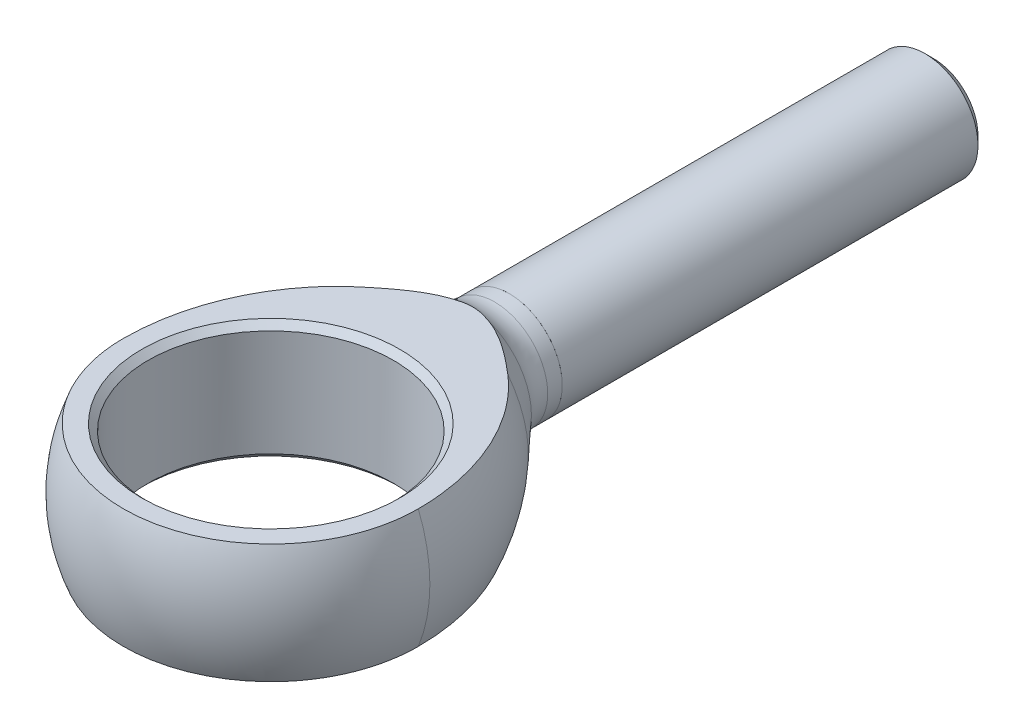
ISO-10303-21;
HEADER;
FILE_DESCRIPTION(('STEP AP214'),'2;1');
FILE_NAME('part.step','',(''),(''),'','','');
FILE_SCHEMA(('AUTOMOTIVE_DESIGN { 1 0 10303 214 1 1 1 1 }'));
ENDSEC;
DATA;
#1=APPLICATION_CONTEXT('core data for automotive mechanical design processes');
#2=APPLICATION_PROTOCOL_DEFINITION('international standard','automotive_design',2000,#1);
#3=PRODUCT_CONTEXT('',#1,'mechanical');
#4=PRODUCT('Part','Part','',(#3));
#5=PRODUCT_RELATED_PRODUCT_CATEGORY('part','',(#4));
#6=PRODUCT_DEFINITION_FORMATION('','',#4);
#7=PRODUCT_DEFINITION_CONTEXT('part definition',#1,'design');
#8=PRODUCT_DEFINITION('design','',#6,#7);
#9=PRODUCT_DEFINITION_SHAPE('','',#8);
#10=(LENGTH_UNIT() NAMED_UNIT(*) SI_UNIT(.MILLI.,.METRE.));
#11=(NAMED_UNIT(*) PLANE_ANGLE_UNIT() SI_UNIT($,.RADIAN.));
#12=(NAMED_UNIT(*) SI_UNIT($,.STERADIAN.) SOLID_ANGLE_UNIT());
#13=UNCERTAINTY_MEASURE_WITH_UNIT(LENGTH_MEASURE(1.E-05),#10,'distance_accuracy_value','');
#14=(GEOMETRIC_REPRESENTATION_CONTEXT(3) GLOBAL_UNCERTAINTY_ASSIGNED_CONTEXT((#13)) GLOBAL_UNIT_ASSIGNED_CONTEXT((#10,
#11,#12)) REPRESENTATION_CONTEXT('',''));
#15=CARTESIAN_POINT('',(0.,0.,0.));
#16=DIRECTION('',(0.,0.,1.));
#17=DIRECTION('',(1.,0.,0.));
#18=AXIS2_PLACEMENT_3D('',#15,#16,#17);
#19=CARTESIAN_POINT('',(0.,0.,39.6748));
#20=DIRECTION('',(0.,-1.,0.));
#21=DIRECTION('',(0.,0.,-1.));
#22=AXIS2_PLACEMENT_3D('',#19,#20,#21);
#23=CYLINDRICAL_SURFACE('',#22,7.3406);
#24=CARTESIAN_POINT('',(0.,-3.1877,39.6748));
#25=DIRECTION('',(0.,-1.,0.));
#26=DIRECTION('',(1.,0.,0.));
#27=AXIS2_PLACEMENT_3D('',#24,#25,#26);
#28=CIRCLE('',#27,7.3406);
#29=CARTESIAN_POINT('',(7.3406,-3.1877,39.6748));
#30=VERTEX_POINT('',#29);
#31=EDGE_CURVE('E116',#30,#30,#28,.T.);
#32=ORIENTED_EDGE('',*,*,#31,.T.);
#33=EDGE_LOOP('',(#32));
#34=FACE_BOUND('',#33,.T.);
#35=CARTESIAN_POINT('',(0.,3.1877,39.6748));
#36=DIRECTION('',(0.,1.,0.));
#37=DIRECTION('',(1.,0.,0.));
#38=AXIS2_PLACEMENT_3D('',#35,#36,#37);
#39=CIRCLE('',#38,7.3406);
#40=CARTESIAN_POINT('',(7.3406,3.1877,39.6748));
#41=VERTEX_POINT('',#40);
#42=EDGE_CURVE('E90',#41,#41,#39,.T.);
#43=ORIENTED_EDGE('',*,*,#42,.T.);
#44=EDGE_LOOP('',(#43));
#45=FACE_BOUND('',#44,.T.);
#46=ADVANCED_FACE('F16',(#34,#45),#23,.F.);
#47=CARTESIAN_POINT('',(0.,-3.5687,39.6748));
#48=DIRECTION('',(0.,-1.,0.));
#49=DIRECTION('',(0.,0.,-1.));
#50=AXIS2_PLACEMENT_3D('',#47,#48,#49);
#51=CONICAL_SURFACE('',#50,7.7216,0.78539816339745);
#52=ORIENTED_EDGE('',*,*,#31,.F.);
#53=EDGE_LOOP('',(#52));
#54=FACE_BOUND('',#53,.T.);
#55=CARTESIAN_POINT('',(0.,-3.5687,39.6748));
#56=DIRECTION('',(0.,-1.,0.));
#57=DIRECTION('',(0.,0.,-1.));
#58=AXIS2_PLACEMENT_3D('',#55,#56,#57);
#59=CIRCLE('',#58,7.7216);
#60=CARTESIAN_POINT('',(0.,-3.5687,31.9532));
#61=VERTEX_POINT('',#60);
#62=EDGE_CURVE('E21',#61,#61,#59,.T.);
#63=ORIENTED_EDGE('',*,*,#62,.T.);
#64=EDGE_LOOP('',(#63));
#65=FACE_BOUND('',#64,.T.);
#66=ADVANCED_FACE('F231',(#54,#65),#51,.F.);
#67=CARTESIAN_POINT('',(0.,3.5687,39.6748));
#68=DIRECTION('',(0.,1.,0.));
#69=DIRECTION('',(0.,0.,1.));
#70=AXIS2_PLACEMENT_3D('',#67,#68,#69);
#71=CONICAL_SURFACE('',#70,7.7216,0.78539816339745);
#72=ORIENTED_EDGE('',*,*,#42,.F.);
#73=EDGE_LOOP('',(#72));
#74=FACE_BOUND('',#73,.T.);
#75=CARTESIAN_POINT('',(0.,3.5687,39.6748));
#76=DIRECTION('',(0.,1.,0.));
#77=DIRECTION('',(0.,0.,1.));
#78=AXIS2_PLACEMENT_3D('',#75,#76,#77);
#79=CIRCLE('',#78,7.7216);
#80=CARTESIAN_POINT('',(0.,3.5687,47.3964));
#81=VERTEX_POINT('',#80);
#82=EDGE_CURVE('E109',#81,#81,#79,.T.);
#83=ORIENTED_EDGE('',*,*,#82,.T.);
#84=EDGE_LOOP('',(#83));
#85=FACE_BOUND('',#84,.T.);
#86=ADVANCED_FACE('F200',(#74,#85),#71,.F.);
#87=CARTESIAN_POINT('',(0.,0.,39.6748));
#88=DIRECTION('',(0.,0.,-1.));
#89=DIRECTION('',(-1.,0.,0.));
#90=AXIS2_PLACEMENT_3D('',#87,#88,#89);
#91=DEGENERATE_TOROIDAL_SURFACE('',#90,4.76249999999994,14.2874999999999,.F.);
#92=CARTESIAN_POINT('',(4.53573153434096,3.5687,30.0223049086918));
#93=CARTESIAN_POINT('',(4.64648576293524,3.5687,30.117302399158));
#94=CARTESIAN_POINT('',(4.75529966894867,3.5687,30.214530276842));
#95=CARTESIAN_POINT('',(4.96900945823194,3.5687,30.4131812578766));
#96=CARTESIAN_POINT('',(5.07390573225779,3.5687,30.514603940687));
#97=CARTESIAN_POINT('',(5.38254770100075,3.5687,30.8246474940286));
#98=CARTESIAN_POINT('',(5.58040477149253,3.5687,31.0391802608053));
#99=CARTESIAN_POINT('',(5.95954243889351,3.5687,31.481690431415));
#100=CARTESIAN_POINT('',(6.14085227159347,3.5687,31.7096429046874));
#101=CARTESIAN_POINT('',(6.48691224719287,3.5687,32.1778533220306));
#102=CARTESIAN_POINT('',(6.65165877204519,3.5687,32.418113937434));
#103=CARTESIAN_POINT('',(6.98566865145013,3.5687,32.9434024278442));
#104=CARTESIAN_POINT('',(7.15241710009485,3.5687,33.2300322429158));
#105=CARTESIAN_POINT('',(7.46318740684696,3.5687,33.8153569294234));
#106=CARTESIAN_POINT('',(7.60720809909156,3.5687,34.1140524188042));
#107=CARTESIAN_POINT('',(7.87206547108056,3.5687,34.7218850817827));
#108=CARTESIAN_POINT('',(7.99287979374436,3.5687,35.0310319905321));
#109=CARTESIAN_POINT('',(8.21064498832464,3.5687,35.6576157087496));
#110=CARTESIAN_POINT('',(8.30759646841529,3.5687,35.9750523067166));
#111=CARTESIAN_POINT('',(8.46529586292842,3.5687,36.5712471847872));
#112=CARTESIAN_POINT('',(8.52921684550582,3.5687,36.8491717212913));
#113=CARTESIAN_POINT('',(8.63892191677755,3.5687,37.4085599298032));
#114=CARTESIAN_POINT('',(8.68470753903626,3.5687,37.6900233004821));
#115=CARTESIAN_POINT('',(8.75792364371986,3.5687,38.2547743457093));
#116=CARTESIAN_POINT('',(8.78538921875067,3.5687,38.5380574768877));
#117=CARTESIAN_POINT('',(8.82203086855191,3.5687,39.1058265819836));
#118=CARTESIAN_POINT('',(8.83120549923354,3.5687,39.3903126490974));
#119=CARTESIAN_POINT('',(8.83119501030297,3.5687,39.6748));
#120=B_SPLINE_CURVE_WITH_KNOTS('',3,(#92,#93,#94,#95,#96,#97,#98,#99,#100,#101,#102,#103,#104,
#105,#106,#107,#108,#109,#110,#111,#112,#113,#114,#115,#116,#117,#118,#119),.UNSPECIFIED.,.F.,
.F.,(4,2,2,2,2,2,2,2,2,2,2,2,2,4),(0.,0.437676001290921,0.875308230275964,1.74994768524289,
2.62301062817699,3.4962638683035,4.4900430187027,5.48387313030376,6.47865595047768,
7.47341341475022,8.32837262265019,9.18325951795017,10.0365041124033,10.8898160687239),.UNSPECIFIED.);
#121=CARTESIAN_POINT('',(4.53573153428068,3.5687,30.0223049087466));
#122=VERTEX_POINT('',#121);
#123=CARTESIAN_POINT('',(8.83119501030297,3.5687,39.6748));
#124=VERTEX_POINT('',#123);
#125=EDGE_CURVE('E94',#122,#124,#120,.T.);
#126=ORIENTED_EDGE('',*,*,#125,.T.);
#127=CARTESIAN_POINT('',(0.,0.,39.6748));
#128=DIRECTION('',(0.,0.,1.));
#129=DIRECTION('',(1.,0.,0.));
#130=AXIS2_PLACEMENT_3D('',#127,#128,#129);
#131=CIRCLE('',#130,9.52500000000001);
#132=CARTESIAN_POINT('',(9.525,0.,39.6748));
#133=VERTEX_POINT('',#132);
#134=EDGE_CURVE('E85',#133,#124,#131,.T.);
#135=ORIENTED_EDGE('',*,*,#134,.F.);
#136=CARTESIAN_POINT('',(0.,0.,39.6748000000001));
#137=DIRECTION('',(0.,0.,-1.));
#138=DIRECTION('',(-1.,0.,0.));
#139=AXIS2_PLACEMENT_3D('',#136,#137,#138);
#140=CIRCLE('',#139,9.52499999999999);
#141=CARTESIAN_POINT('',(8.83119501030296,-3.5687,39.6748));
#142=VERTEX_POINT('',#141);
#143=EDGE_CURVE('E73',#133,#142,#140,.T.);
#144=ORIENTED_EDGE('',*,*,#143,.T.);
#145=CARTESIAN_POINT('',(8.83119501030298,-3.5687,39.6748));
#146=CARTESIAN_POINT('',(8.83123831016164,-3.5687,39.2696396775057));
#147=CARTESIAN_POINT('',(8.8126082645415,-3.5687,38.8644816279537));
#148=CARTESIAN_POINT('',(8.73830837516098,-3.5687,38.0574948990597));
#149=CARTESIAN_POINT('',(8.68263117250918,-3.5687,37.6556668972428));
#150=CARTESIAN_POINT('',(8.53424384266758,-3.5687,36.8572131919228));
#151=CARTESIAN_POINT('',(8.44138446058894,-3.5687,36.4606151914424));
#152=CARTESIAN_POINT('',(8.21928385480463,-3.5687,35.6778184111658));
#153=CARTESIAN_POINT('',(8.09004954110935,-3.5687,35.2916176714928));
#154=CARTESIAN_POINT('',(7.80867674698769,-3.5687,34.5656925456585));
#155=CARTESIAN_POINT('',(7.65947442628895,-3.5687,34.2248322305277));
#156=CARTESIAN_POINT('',(7.33223451333594,-3.5687,33.5573821144998));
#157=CARTESIAN_POINT('',(7.15419322899904,-3.5687,33.2307941476143));
#158=CARTESIAN_POINT('',(6.5792819363127,-3.5687,32.2786926519637));
#159=CARTESIAN_POINT('',(6.14027876983394,-3.5687,31.6773551317835));
#160=CARTESIAN_POINT('',(5.47714073271548,-3.5687,30.9269650194731));
#161=CARTESIAN_POINT('',(5.29768026565356,-3.5687,30.736938824473));
#162=CARTESIAN_POINT('',(5.01901759548722,-3.5687,30.4614761905751));
#163=CARTESIAN_POINT('',(4.92456362733509,-3.5687,30.3712619731917));
#164=CARTESIAN_POINT('',(4.73249951913429,-3.5687,30.1941987339203));
#165=CARTESIAN_POINT('',(4.63488841369071,-3.5687,30.1073507595597));
#166=CARTESIAN_POINT('',(4.53573153434155,-3.5687,30.0223049086923));
#167=B_SPLINE_CURVE_WITH_KNOTS('',3,(#145,#146,#147,#148,#149,#150,#151,#152,#153,#154,#155,
#156,#157,#158,#159,#160,#161,#162,#163,#164,#165,#166),.UNSPECIFIED.,.F.,.F.,(4,2,2,2,2,2,2,2,
2,2,4),(0.,1.21505053240972,2.43034248942414,3.65056251782993,4.87055090184374,5.98533436670334,
7.10026066368888,9.31903917529367,10.1027485937625,10.4945065468152,10.8863854463865),.UNSPECIFIED.);
#168=CARTESIAN_POINT('',(4.53573153432162,-3.5687,30.0223049087155));
#169=VERTEX_POINT('',#168);
#170=EDGE_CURVE('E222',#142,#169,#167,.T.);
#171=ORIENTED_EDGE('',*,*,#170,.T.);
#172=CARTESIAN_POINT('',(0.,0.,30.0223049087549));
#173=DIRECTION('',(0.,0.,1.));
#174=DIRECTION('',(1.,0.,0.));
#175=AXIS2_PLACEMENT_3D('',#172,#173,#174);
#176=CIRCLE('',#175,5.7713499496117);
#177=EDGE_CURVE('E106',#122,#169,#176,.F.);
#178=ORIENTED_EDGE('',*,*,#177,.F.);
#179=EDGE_LOOP('',(#126,#135,#144,#171,#178));
#180=FACE_BOUND('',#179,.T.);
#181=ADVANCED_FACE('F92',(#180),#91,.F.);
#182=CARTESIAN_POINT('',(0.,0.,39.6748));
#183=DIRECTION('',(1.,0.,0.));
#184=DIRECTION('',(0.,1.,0.));
#185=AXIS2_PLACEMENT_3D('',#182,#183,#184);
#186=SPHERICAL_SURFACE('',#185,9.52500000000001);
#187=CARTESIAN_POINT('',(8.83119501030297,3.5687,39.6748));
#188=CARTESIAN_POINT('',(8.83122171566859,3.5687,39.923180146276));
#189=CARTESIAN_POINT('',(8.82071747628649,3.5687,40.1715564511723));
#190=CARTESIAN_POINT('',(8.77883999257175,3.5687,40.6665321015705));
#191=CARTESIAN_POINT('',(8.74746774748768,3.5687,40.9131315315852));
#192=CARTESIAN_POINT('',(8.66407642168427,3.5687,41.4026361757057));
#193=CARTESIAN_POINT('',(8.61207186953437,3.5687,41.6455438647049));
#194=CARTESIAN_POINT('',(8.48779427998598,3.5687,42.1261143564974));
#195=CARTESIAN_POINT('',(8.41552148888246,3.5687,42.3637772229867));
#196=CARTESIAN_POINT('',(8.2511802240747,3.5687,42.8322811294422));
#197=CARTESIAN_POINT('',(8.15910259437063,3.5687,43.0631189577806));
#198=CARTESIAN_POINT('',(7.95582515814277,3.5687,43.5162199568318));
#199=CARTESIAN_POINT('',(7.84462504992993,3.5687,43.7384829921952));
#200=CARTESIAN_POINT('',(7.60391861433427,3.5687,44.1728060874066));
#201=CARTESIAN_POINT('',(7.47441599509076,3.5687,44.3848682023529));
#202=CARTESIAN_POINT('',(7.19800874545437,3.5687,44.7973292913575));
#203=CARTESIAN_POINT('',(7.05110419429008,3.5687,44.9977283185099));
#204=CARTESIAN_POINT('',(6.74095992416594,3.5687,45.3854109411177));
#205=CARTESIAN_POINT('',(6.57772263842186,3.5687,45.5726964831463));
#206=CARTESIAN_POINT('',(6.23599536569565,3.5687,45.9329165210914));
#207=CARTESIAN_POINT('',(6.05750011640509,3.5687,46.1058460249011));
#208=CARTESIAN_POINT('',(5.68658013615901,3.5687,46.436047189752));
#209=CARTESIAN_POINT('',(5.49415580037298,3.5687,46.5933192946945));
#210=CARTESIAN_POINT('',(5.09673824493745,3.5687,46.8910953331393));
#211=CARTESIAN_POINT('',(4.89174482901489,3.5687,47.0315990046924));
#212=CARTESIAN_POINT('',(4.47066275892946,3.5687,47.2948279422094));
#213=CARTESIAN_POINT('',(4.25457480487811,3.5687,47.4175543281311));
#214=CARTESIAN_POINT('',(3.81282319722303,3.5687,47.6443692020164));
#215=CARTESIAN_POINT('',(3.58715933316482,3.5687,47.7484572800942));
#216=CARTESIAN_POINT('',(3.12792179353987,3.5687,47.9372287476397));
#217=CARTESIAN_POINT('',(2.8943500901882,3.5687,48.0219169351131));
#218=CARTESIAN_POINT('',(2.42082194633713,3.5687,48.171345596247));
#219=CARTESIAN_POINT('',(2.18086333036626,3.5687,48.2360791761367));
#220=CARTESIAN_POINT('',(1.69638470349105,3.5687,48.3450897868325));
#221=CARTESIAN_POINT('',(1.45186544050128,3.5687,48.3893701416667));
#222=CARTESIAN_POINT('',(0.959960626560062,3.5687,48.4571757708174));
#223=CARTESIAN_POINT('',(0.712575014846095,3.5687,48.4807006043279));
#224=CARTESIAN_POINT('',(0.216698310362471,3.5687,48.5068264940322));
#225=CARTESIAN_POINT('',(-0.0317927960998583,3.5687,48.5094272903347));
#226=CARTESIAN_POINT('',(-0.528110776996124,3.5687,48.493685935912));
#227=CARTESIAN_POINT('',(-0.775937651427227,3.5687,48.4753437850975));
#228=CARTESIAN_POINT('',(-1.26916540058866,3.5687,48.4178469176815));
#229=CARTESIAN_POINT('',(-1.51456627367107,3.5687,48.3786921869435));
#230=CARTESIAN_POINT('',(-2.00119195968939,3.5687,48.2798495856406));
#231=CARTESIAN_POINT('',(-2.2424168611546,3.5687,48.2201621509238));
#232=CARTESIAN_POINT('',(-2.71902398626938,3.5687,48.0806657090128));
#233=CARTESIAN_POINT('',(-2.95440515063128,3.5687,48.0008530825814));
#234=CARTESIAN_POINT('',(-3.41752573306827,3.5687,47.8217101621286));
#235=CARTESIAN_POINT('',(-3.64526775950872,3.5687,47.7223866111477));
#236=CARTESIAN_POINT('',(-4.09162365225351,3.5687,47.5048874164072));
#237=CARTESIAN_POINT('',(-4.31023559290495,3.5687,47.386707820748));
#238=CARTESIAN_POINT('',(-4.73672151242847,3.5687,47.1323545419922));
#239=CARTESIAN_POINT('',(-4.94459572821736,3.5687,46.9961812561439));
#240=CARTESIAN_POINT('',(-5.34812735662121,3.5687,46.7068111212312));
#241=CARTESIAN_POINT('',(-5.54378514136452,3.5687,46.5536147911064));
#242=CARTESIAN_POINT('',(-5.92149687142085,3.5687,46.2312868284894));
#243=CARTESIAN_POINT('',(-6.10355102950633,3.5687,46.0621554453286));
#244=CARTESIAN_POINT('',(-6.45277277881423,3.5687,45.709149496455));
#245=CARTESIAN_POINT('',(-6.61993968181027,3.5687,45.5252742498905));
#246=CARTESIAN_POINT('',(-6.93813385928713,3.5687,45.1441606915925));
#247=CARTESIAN_POINT('',(-7.08916669533654,3.5687,44.9469270231936));
#248=CARTESIAN_POINT('',(-7.37415820825529,3.5687,44.5403380920559));
#249=CARTESIAN_POINT('',(-7.50810819431931,3.5687,44.3309767375619));
#250=CARTESIAN_POINT('',(-7.75788785254546,3.5687,43.90171877794));
#251=CARTESIAN_POINT('',(-7.87371807680518,3.5687,43.6818224940714));
#252=CARTESIAN_POINT('',(-8.08650700732415,3.5687,43.2329104545177));
#253=CARTESIAN_POINT('',(-8.18345368429091,3.5687,43.0038889970201));
#254=CARTESIAN_POINT('',(-8.35769175439011,3.5687,42.5384913816794));
#255=CARTESIAN_POINT('',(-8.43498357432824,3.5687,42.3021153836655));
#256=CARTESIAN_POINT('',(-8.56927791566514,3.5687,41.8240013913995));
#257=CARTESIAN_POINT('',(-8.62630625672867,3.5687,41.5822706406529));
#258=CARTESIAN_POINT('',(-8.71978509105483,3.5687,41.0949615845735));
#259=CARTESIAN_POINT('',(-8.75624568564022,3.5687,40.8493852289256));
#260=CARTESIAN_POINT('',(-8.79860297564235,3.5687,40.4485286765697));
#261=CARTESIAN_POINT('',(-8.81083277880204,3.5687,40.2938901404062));
#262=CARTESIAN_POINT('',(-8.82712294304932,3.5687,39.9844397692758));
#263=CARTESIAN_POINT('',(-8.83119677606848,3.56869999999999,39.8296286434136));
#264=CARTESIAN_POINT('',(-8.83119501030298,3.56869999999998,39.6748));
#265=B_SPLINE_CURVE_WITH_KNOTS('',3,(#187,#188,#189,#190,#191,#192,#193,#194,#195,#196,#197,
#198,#199,#200,#201,#202,#203,#204,#205,#206,#207,#208,#209,#210,#211,#212,#213,#214,#215,#216,
#217,#218,#219,#220,#221,#222,#223,#224,#225,#226,#227,#228,#229,#230,#231,#232,#233,#234,#235,
#236,#237,#238,#239,#240,#241,#242,#243,#244,#245,#246,#247,#248,#249,#250,#251,#252,#253,#254,
#255,#256,#257,#258,#259,#260,#261,#262,#263,#264),.UNSPECIFIED.,.F.,.F.,(4,2,2,2,2,2,2,2,2,2,2,
2,2,2,2,2,2,2,2,2,2,2,2,2,2,2,2,2,2,2,2,2,2,2,2,2,2,2,4),(0.,0.744912999131717,1.48979033123891,
2.23414407435863,2.97848877265495,3.72317833238488,4.4678796419146,5.21243028861929,
5.95697754561802,6.70141404625403,7.44610833905499,8.19078151308272,8.93546631855233,
9.68010418893147,10.4247584330668,11.1692283090497,11.9139550914973,12.6585607994195,
13.4031823209066,14.1478130911075,14.8924438644857,15.6370751436375,16.3816906174596,
17.1264400956935,17.8709326374356,18.6155814173474,19.3602137603283,20.1048234097635,
20.8494214104226,21.5940538154264,22.3384287044962,23.0831807921712,23.8279101833028,
24.5731124452109,25.3182985236518,26.0625316541528,26.8063989546481,27.2715654557138,
27.7359629644156),.UNSPECIFIED.);
#266=CARTESIAN_POINT('',(-8.83119501030296,3.5687,39.6748));
#267=VERTEX_POINT('',#266);
#268=EDGE_CURVE('E175',#124,#267,#265,.T.);
#269=ORIENTED_EDGE('',*,*,#268,.T.);
#270=CARTESIAN_POINT('',(0.,0.,39.6748));
#271=DIRECTION('',(0.,0.,-1.));
#272=DIRECTION('',(-1.,0.,0.));
#273=AXIS2_PLACEMENT_3D('',#270,#271,#272);
#274=CIRCLE('',#273,9.52499999999998);
#275=CARTESIAN_POINT('',(-9.525,0.,39.6748));
#276=VERTEX_POINT('',#275);
#277=EDGE_CURVE('E95',#276,#267,#274,.T.);
#278=ORIENTED_EDGE('',*,*,#277,.F.);
#279=CARTESIAN_POINT('',(0.,0.,39.6748));
#280=DIRECTION('',(0.,0.,-1.));
#281=DIRECTION('',(1.,0.,0.));
#282=AXIS2_PLACEMENT_3D('',#279,#280,#281);
#283=CIRCLE('',#282,9.52500000000001);
#284=CARTESIAN_POINT('',(-8.83119501030297,-3.5687,39.6748));
#285=VERTEX_POINT('',#284);
#286=EDGE_CURVE('E79',#276,#285,#283,.F.);
#287=ORIENTED_EDGE('',*,*,#286,.T.);
#288=CARTESIAN_POINT('',(-8.83119501030298,-3.5687,39.6748));
#289=CARTESIAN_POINT('',(-8.83122171566861,-3.5687,39.923180146276));
#290=CARTESIAN_POINT('',(-8.8207174762865,-3.5687,40.1715564511723));
#291=CARTESIAN_POINT('',(-8.77883999257175,-3.5687,40.6665321015705));
#292=CARTESIAN_POINT('',(-8.74746774748768,-3.5687,40.9131315315852));
#293=CARTESIAN_POINT('',(-8.66407642168428,-3.5687,41.4026361757057));
#294=CARTESIAN_POINT('',(-8.61207186953438,-3.5687,41.6455438647049));
#295=CARTESIAN_POINT('',(-8.48779427998599,-3.5687,42.1261143564974));
#296=CARTESIAN_POINT('',(-8.41552148888247,-3.5687,42.3637772229867));
#297=CARTESIAN_POINT('',(-8.25118022407471,-3.5687,42.8322811294422));
#298=CARTESIAN_POINT('',(-8.15910259437064,-3.5687,43.0631189577806));
#299=CARTESIAN_POINT('',(-7.95582515814277,-3.5687,43.5162199568318));
#300=CARTESIAN_POINT('',(-7.84462504992994,-3.5687,43.7384829921952));
#301=CARTESIAN_POINT('',(-7.60391861433428,-3.5687,44.1728060874066));
#302=CARTESIAN_POINT('',(-7.47441599509077,-3.5687,44.3848682023529));
#303=CARTESIAN_POINT('',(-7.19800874545437,-3.5687,44.7973292913575));
#304=CARTESIAN_POINT('',(-7.05110419429009,-3.56869999999999,44.99772831851));
#305=CARTESIAN_POINT('',(-6.74095992416594,-3.56869999999999,45.3854109411177));
#306=CARTESIAN_POINT('',(-6.57772263842186,-3.5687,45.5726964831463));
#307=CARTESIAN_POINT('',(-6.23599536569566,-3.5687,45.9329165210914));
#308=CARTESIAN_POINT('',(-6.0575001164051,-3.5687,46.1058460249011));
#309=CARTESIAN_POINT('',(-5.68658013615901,-3.5687,46.436047189752));
#310=CARTESIAN_POINT('',(-5.49415580037298,-3.5687,46.5933192946945));
#311=CARTESIAN_POINT('',(-5.09673824493745,-3.5687,46.8910953331393));
#312=CARTESIAN_POINT('',(-4.89174482901489,-3.5687,47.0315990046924));
#313=CARTESIAN_POINT('',(-4.47066275892946,-3.5687,47.2948279422094));
#314=CARTESIAN_POINT('',(-4.25457480487811,-3.5687,47.4175543281311));
#315=CARTESIAN_POINT('',(-3.81282319722303,-3.5687,47.6443692020164));
#316=CARTESIAN_POINT('',(-3.58715933316482,-3.5687,47.7484572800942));
#317=CARTESIAN_POINT('',(-3.12792179353987,-3.5687,47.9372287476398));
#318=CARTESIAN_POINT('',(-2.8943500901882,-3.5687,48.0219169351131));
#319=CARTESIAN_POINT('',(-2.42082194633712,-3.5687,48.171345596247));
#320=CARTESIAN_POINT('',(-2.18086333036625,-3.5687,48.2360791761367));
#321=CARTESIAN_POINT('',(-1.69638470349104,-3.5687,48.3450897868325));
#322=CARTESIAN_POINT('',(-1.45186544050128,-3.5687,48.3893701416667));
#323=CARTESIAN_POINT('',(-0.959960626560058,-3.5687,48.4571757708174));
#324=CARTESIAN_POINT('',(-0.71257501484609,-3.5687,48.4807006043279));
#325=CARTESIAN_POINT('',(-0.216698310362466,-3.5687,48.5068264940322));
#326=CARTESIAN_POINT('',(0.0317927960998628,-3.5687,48.5094272903347));
#327=CARTESIAN_POINT('',(0.528110776996129,-3.5687,48.493685935912));
#328=CARTESIAN_POINT('',(0.775937651427232,-3.5687,48.4753437850975));
#329=CARTESIAN_POINT('',(1.26916540058866,-3.5687,48.4178469176815));
#330=CARTESIAN_POINT('',(1.51456627367107,-3.5687,48.3786921869435));
#331=CARTESIAN_POINT('',(2.0011919596894,-3.5687,48.2798495856406));
#332=CARTESIAN_POINT('',(2.24241686115461,-3.5687,48.2201621509238));
#333=CARTESIAN_POINT('',(2.71902398626939,-3.5687,48.0806657090128));
#334=CARTESIAN_POINT('',(2.95440515063128,-3.5687,48.0008530825813));
#335=CARTESIAN_POINT('',(3.41752573306827,-3.5687,47.8217101621286));
#336=CARTESIAN_POINT('',(3.64526775950872,-3.5687,47.7223866111477));
#337=CARTESIAN_POINT('',(4.09162365225352,-3.5687,47.5048874164072));
#338=CARTESIAN_POINT('',(4.31023559290496,-3.5687,47.386707820748));
#339=CARTESIAN_POINT('',(4.73672151242848,-3.5687,47.1323545419922));
#340=CARTESIAN_POINT('',(4.94459572821737,-3.5687,46.9961812561439));
#341=CARTESIAN_POINT('',(5.34812735662121,-3.5687,46.7068111212312));
#342=CARTESIAN_POINT('',(5.54378514136452,-3.5687,46.5536147911064));
#343=CARTESIAN_POINT('',(5.92149687142086,-3.5687,46.2312868284894));
#344=CARTESIAN_POINT('',(6.10355102950633,-3.5687,46.0621554453286));
#345=CARTESIAN_POINT('',(6.45277277881423,-3.5687,45.709149496455));
#346=CARTESIAN_POINT('',(6.61993968181027,-3.5687,45.5252742498905));
#347=CARTESIAN_POINT('',(6.93813385928713,-3.5687,45.1441606915925));
#348=CARTESIAN_POINT('',(7.08916669533655,-3.5687,44.9469270231936));
#349=CARTESIAN_POINT('',(7.37415820825529,-3.5687,44.5403380920558));
#350=CARTESIAN_POINT('',(7.50810819431931,-3.5687,44.3309767375619));
#351=CARTESIAN_POINT('',(7.75788785254546,-3.5687,43.9017187779399));
#352=CARTESIAN_POINT('',(7.87371807680518,-3.5687,43.6818224940714));
#353=CARTESIAN_POINT('',(8.08650700732415,-3.5687,43.2329104545177));
#354=CARTESIAN_POINT('',(8.18345368429091,-3.5687,43.0038889970201));
#355=CARTESIAN_POINT('',(8.3576917543901,-3.5687,42.5384913816794));
#356=CARTESIAN_POINT('',(8.43498357432824,-3.5687,42.3021153836654));
#357=CARTESIAN_POINT('',(8.56927791566514,-3.5687,41.8240013913995));
#358=CARTESIAN_POINT('',(8.62630625672867,-3.5687,41.5822706406529));
#359=CARTESIAN_POINT('',(8.71978509105482,-3.5687,41.0949615845734));
#360=CARTESIAN_POINT('',(8.75624568564022,-3.5687,40.8493852289255));
#361=CARTESIAN_POINT('',(8.79860297564234,-3.5687,40.4485286765696));
#362=CARTESIAN_POINT('',(8.81083277880203,-3.5687,40.2938901404062));
#363=CARTESIAN_POINT('',(8.82712294304931,-3.5687,39.9844397692758));
#364=CARTESIAN_POINT('',(8.83119677606847,-3.56869999999999,39.8296286434136));
#365=CARTESIAN_POINT('',(8.83119501030297,-3.56869999999998,39.6748));
#366=B_SPLINE_CURVE_WITH_KNOTS('',3,(#288,#289,#290,#291,#292,#293,#294,#295,#296,#297,#298,
#299,#300,#301,#302,#303,#304,#305,#306,#307,#308,#309,#310,#311,#312,#313,#314,#315,#316,#317,
#318,#319,#320,#321,#322,#323,#324,#325,#326,#327,#328,#329,#330,#331,#332,#333,#334,#335,#336,
#337,#338,#339,#340,#341,#342,#343,#344,#345,#346,#347,#348,#349,#350,#351,#352,#353,#354,#355,
#356,#357,#358,#359,#360,#361,#362,#363,#364,#365),.UNSPECIFIED.,.F.,.F.,(4,2,2,2,2,2,2,2,2,2,2,
2,2,2,2,2,2,2,2,2,2,2,2,2,2,2,2,2,2,2,2,2,2,2,2,2,2,2,4),(0.,0.744912999131717,1.48979033123891,
2.23414407435864,2.97848877265496,3.7231783323849,4.46787964191461,5.2124302886193,
5.95697754561803,6.70141404625403,7.446108339055,8.19078151308273,8.93546631855235,
9.68010418893148,10.4247584330668,11.1692283090497,11.9139550914973,12.6585607994195,
13.4031823209066,14.1478130911076,14.8924438644857,15.6370751436375,16.3816906174596,
17.1264400956935,17.8709326374356,18.6155814173474,19.3602137603283,20.1048234097635,
20.8494214104226,21.5940538154264,22.3384287044962,23.0831807921712,23.8279101833028,
24.5731124452109,25.3182985236518,26.0625316541529,26.8063989546481,27.2715654557138,
27.7359629644156),.UNSPECIFIED.);
#367=EDGE_CURVE('E88',#285,#142,#366,.T.);
#368=ORIENTED_EDGE('',*,*,#367,.T.);
#369=ORIENTED_EDGE('',*,*,#143,.F.);
#370=ORIENTED_EDGE('',*,*,#134,.T.);
#371=EDGE_LOOP('',(#269,#278,#287,#368,#369,#370));
#372=FACE_BOUND('',#371,.T.);
#373=ADVANCED_FACE('F84',(#372),#186,.T.);
#374=CARTESIAN_POINT('',(0.,0.,39.6748));
#375=DIRECTION('',(0.,0.,-1.));
#376=DIRECTION('',(-1.,0.,0.));
#377=AXIS2_PLACEMENT_3D('',#374,#375,#376);
#378=DEGENERATE_TOROIDAL_SURFACE('',#377,4.76249999999994,14.2874999999999,.F.);
#379=CARTESIAN_POINT('',(-8.83119501030295,3.5687,39.6748));
#380=CARTESIAN_POINT('',(-8.83123831016162,3.5687,39.2696396775057));
#381=CARTESIAN_POINT('',(-8.81260826454148,3.5687,38.8644816279537));
#382=CARTESIAN_POINT('',(-8.73830837516095,3.5687,38.0574948990597));
#383=CARTESIAN_POINT('',(-8.68263117250915,3.5687,37.6556668972428));
#384=CARTESIAN_POINT('',(-8.53424384266755,3.5687,36.8572131919228));
#385=CARTESIAN_POINT('',(-8.44138446058891,3.5687,36.4606151914424));
#386=CARTESIAN_POINT('',(-8.2192838548046,3.5687,35.6778184111658));
#387=CARTESIAN_POINT('',(-8.09004954110932,3.5687,35.2916176714928));
#388=CARTESIAN_POINT('',(-7.80867674698766,3.5687,34.5656925456585));
#389=CARTESIAN_POINT('',(-7.65947442628892,3.5687,34.2248322305277));
#390=CARTESIAN_POINT('',(-7.33223451333592,3.5687,33.5573821144998));
#391=CARTESIAN_POINT('',(-7.15419322899902,3.5687,33.2307941476143));
#392=CARTESIAN_POINT('',(-6.57928193631267,3.5687,32.2786926519637));
#393=CARTESIAN_POINT('',(-6.14027876983392,3.5687,31.6773551317835));
#394=CARTESIAN_POINT('',(-5.47714073271546,3.5687,30.9269650194731));
#395=CARTESIAN_POINT('',(-5.29768026565355,3.5687,30.7369388244731));
#396=CARTESIAN_POINT('',(-5.01901759548721,3.5687,30.4614761905751));
#397=CARTESIAN_POINT('',(-4.92456362733508,3.5687,30.3712619731917));
#398=CARTESIAN_POINT('',(-4.73249951913428,3.5687,30.1941987339203));
#399=CARTESIAN_POINT('',(-4.6348884136907,3.5687,30.1073507595597));
#400=CARTESIAN_POINT('',(-4.53573153434154,3.5687,30.0223049086923));
#401=B_SPLINE_CURVE_WITH_KNOTS('',3,(#379,#380,#381,#382,#383,#384,#385,#386,#387,#388,#389,
#390,#391,#392,#393,#394,#395,#396,#397,#398,#399,#400),.UNSPECIFIED.,.F.,.F.,(4,2,2,2,2,2,2,2,
2,2,4),(0.,1.21505053240972,2.43034248942414,3.65056251782993,4.87055090184374,5.98533436670334,
7.10026066368889,9.31903917529367,10.1027485937625,10.4945065468152,10.8863854463865),.UNSPECIFIED.);
#402=CARTESIAN_POINT('',(-4.53573153432161,3.5687,30.0223049087155));
#403=VERTEX_POINT('',#402);
#404=EDGE_CURVE('E289',#267,#403,#401,.T.);
#405=ORIENTED_EDGE('',*,*,#404,.T.);
#406=CARTESIAN_POINT('',(0.,0.,30.0223049087549));
#407=DIRECTION('',(0.,0.,1.));
#408=DIRECTION('',(1.,0.,0.));
#409=AXIS2_PLACEMENT_3D('',#406,#407,#408);
#410=CIRCLE('',#409,5.7713499496117);
#411=CARTESIAN_POINT('',(-4.53573153428068,-3.5687,30.0223049087466));
#412=VERTEX_POINT('',#411);
#413=EDGE_CURVE('E171',#412,#403,#410,.F.);
#414=ORIENTED_EDGE('',*,*,#413,.F.);
#415=CARTESIAN_POINT('',(-4.53573153434096,-3.5687,30.0223049086918));
#416=CARTESIAN_POINT('',(-4.64648576293523,-3.5687,30.117302399158));
#417=CARTESIAN_POINT('',(-4.75529966894867,-3.5687,30.214530276842));
#418=CARTESIAN_POINT('',(-4.96900945823193,-3.5687,30.4131812578766));
#419=CARTESIAN_POINT('',(-5.07390573225779,-3.5687,30.514603940687));
#420=CARTESIAN_POINT('',(-5.38254770100075,-3.5687,30.8246474940286));
#421=CARTESIAN_POINT('',(-5.58040477149252,-3.5687,31.0391802608053));
#422=CARTESIAN_POINT('',(-5.95954243889351,-3.5687,31.481690431415));
#423=CARTESIAN_POINT('',(-6.14085227159346,-3.5687,31.7096429046874));
#424=CARTESIAN_POINT('',(-6.48691224719287,-3.5687,32.1778533220306));
#425=CARTESIAN_POINT('',(-6.65165877204519,-3.5687,32.418113937434));
#426=CARTESIAN_POINT('',(-6.98566865145013,-3.5687,32.9434024278442));
#427=CARTESIAN_POINT('',(-7.15241710009485,-3.5687,33.2300322429158));
#428=CARTESIAN_POINT('',(-7.46318740684695,-3.5687,33.8153569294234));
#429=CARTESIAN_POINT('',(-7.60720809909155,-3.5687,34.1140524188042));
#430=CARTESIAN_POINT('',(-7.87206547108056,-3.5687,34.7218850817827));
#431=CARTESIAN_POINT('',(-7.99287979374436,-3.5687,35.0310319905321));
#432=CARTESIAN_POINT('',(-8.21064498832463,-3.5687,35.6576157087496));
#433=CARTESIAN_POINT('',(-8.30759646841529,-3.5687,35.9750523067166));
#434=CARTESIAN_POINT('',(-8.46529586292841,-3.5687,36.5712471847872));
#435=CARTESIAN_POINT('',(-8.52921684550581,-3.5687,36.8491717212913));
#436=CARTESIAN_POINT('',(-8.63892191677754,-3.5687,37.4085599298032));
#437=CARTESIAN_POINT('',(-8.68470753903624,-3.5687,37.6900233004821));
#438=CARTESIAN_POINT('',(-8.75792364371985,-3.5687,38.2547743457093));
#439=CARTESIAN_POINT('',(-8.78538921875066,-3.5687,38.5380574768877));
#440=CARTESIAN_POINT('',(-8.8220308685519,-3.5687,39.1058265819836));
#441=CARTESIAN_POINT('',(-8.83120549923353,-3.5687,39.3903126490974));
#442=CARTESIAN_POINT('',(-8.83119501030296,-3.5687,39.6748));
#443=B_SPLINE_CURVE_WITH_KNOTS('',3,(#415,#416,#417,#418,#419,#420,#421,#422,#423,#424,#425,
#426,#427,#428,#429,#430,#431,#432,#433,#434,#435,#436,#437,#438,#439,#440,#441,#442),
.UNSPECIFIED.,.F.,.F.,(4,2,2,2,2,2,2,2,2,2,2,2,2,4),(0.,0.43767600129092,0.875308230275964,
1.74994768524289,2.62301062817699,3.4962638683035,4.4900430187027,5.48387313030375,
6.47865595047767,7.47341341475023,8.32837262265019,9.18325951795016,10.0365041124033,
10.8898160687239),.UNSPECIFIED.);
#444=EDGE_CURVE('E209',#412,#285,#443,.T.);
#445=ORIENTED_EDGE('',*,*,#444,.T.);
#446=ORIENTED_EDGE('',*,*,#286,.F.);
#447=ORIENTED_EDGE('',*,*,#277,.T.);
#448=EDGE_LOOP('',(#405,#414,#445,#446,#447));
#449=FACE_BOUND('',#448,.T.);
#450=ADVANCED_FACE('F18',(#449),#378,.F.);
#451=CARTESIAN_POINT('',(9.525,-3.5687,39.6748));
#452=DIRECTION('',(0.,1.,0.));
#453=DIRECTION('',(-1.,0.,0.));
#454=AXIS2_PLACEMENT_3D('',#451,#452,#453);
#455=PLANE('',#454);
#456=ORIENTED_EDGE('',*,*,#444,.F.);
#457=CARTESIAN_POINT('',(-1.29266625592802,-3.56870000003515,27.8661559850313));
#458=CARTESIAN_POINT('',(-1.39756229416509,-3.56870000001261,27.9051678132153));
#459=CARTESIAN_POINT('',(-1.50103230112086,-3.56870000000338,27.9477951572748));
#460=CARTESIAN_POINT('',(-1.70515646340838,-3.56869999999662,28.0390644279456));
#461=CARTESIAN_POINT('',(-1.80581367441419,-3.56869999999909,28.087699489724));
#462=CARTESIAN_POINT('',(-2.00421589828348,-3.5687000000009,28.1896715055381));
#463=CARTESIAN_POINT('',(-2.10197034494298,-3.56870000000025,28.242990311058));
#464=CARTESIAN_POINT('',(-2.29522551907263,-3.56869999999975,28.3536153058766));
#465=CARTESIAN_POINT('',(-2.39072551944572,-3.56869999999991,28.4109227586747));
#466=CARTESIAN_POINT('',(-2.67276097034969,-3.56870000000017,28.5867972829336));
#467=CARTESIAN_POINT('',(-2.85633035442531,-3.56870000000004,28.7101148582793));
#468=CARTESIAN_POINT('',(-3.21742984297457,-3.56869999999995,28.9655135596928));
#469=CARTESIAN_POINT('',(-3.39495400254418,-3.56869999999999,29.0976029557909));
#470=CARTESIAN_POINT('',(-3.65225119547343,-3.5687,29.2962005457707));
#471=CARTESIAN_POINT('',(-3.73389564695686,-3.5687,29.3603051357153));
#472=CARTESIAN_POINT('',(-3.89621397782917,-3.5687,29.4896675316165));
#473=CARTESIAN_POINT('',(-3.97688822723677,-3.5687,29.5549248728728));
#474=CARTESIAN_POINT('',(-4.13767538313368,-3.5687,29.6866767151875));
#475=CARTESIAN_POINT('',(-4.21778546463666,-3.5687,29.7531746566265));
#476=CARTESIAN_POINT('',(-4.3772846881678,-3.5687,29.887088711996));
#477=CARTESIAN_POINT('',(-4.45667355665177,-3.5687,29.9545051518974));
#478=CARTESIAN_POINT('',(-4.53573153430125,-3.5687,30.0223049087384));
#479=B_SPLINE_CURVE_WITH_KNOTS('',3,(#457,#458,#459,#460,#461,#462,#463,#464,#465,#466,#467,
#468,#469,#470,#471,#472,#473,#474,#475,#476,#477,#478),.UNSPECIFIED.,.F.,.F.,(4,2,2,2,2,2,2,2,
2,2,4),(0.,0.335569250774936,0.670758543703163,1.00470196211775,1.33875165082478,
2.00176973217835,2.66542203046743,2.97682459663314,3.28810437139979,3.60043795660698,
3.91288543482328),.UNSPECIFIED.);
#480=CARTESIAN_POINT('',(-1.29266625594848,-3.5687,27.8661559849762));
#481=VERTEX_POINT('',#480);
#482=EDGE_CURVE('E218',#481,#412,#479,.T.);
#483=ORIENTED_EDGE('',*,*,#482,.F.);
#484=CARTESIAN_POINT('',(-1.29266625597418,-3.5687,27.8661559849071));
#485=CARTESIAN_POINT('',(-1.24590949930305,-3.5687,27.848784647138));
#486=CARTESIAN_POINT('',(-1.19905037373049,-3.5687,27.8316737560573));
#487=CARTESIAN_POINT('',(-1.10474069453062,-3.5687,27.7981495762703));
#488=CARTESIAN_POINT('',(-1.05728827649368,-3.5687,27.7817415487452));
#489=CARTESIAN_POINT('',(-0.961843130950875,-3.5687,27.7499772652667));
#490=CARTESIAN_POINT('',(-0.913849086912329,-3.5687,27.7346249295995));
#491=CARTESIAN_POINT('',(-0.817362634894791,-3.5687,27.7053649953359));
#492=CARTESIAN_POINT('',(-0.768869747586812,-3.5687,27.6914589640255));
#493=CARTESIAN_POINT('',(-0.672474105231117,-3.5687,27.6657793258056));
#494=CARTESIAN_POINT('',(-0.624582273844401,-3.5687,27.6539651113966));
#495=CARTESIAN_POINT('',(-0.528397414051101,-3.5687,27.6324910370669));
#496=CARTESIAN_POINT('',(-0.480105197314078,-3.5687,27.6228275818165));
#497=CARTESIAN_POINT('',(-0.383164247403699,-3.5687,27.6060080521037));
#498=CARTESIAN_POINT('',(-0.334516259062664,-3.5687,27.5988477468718));
#499=CARTESIAN_POINT('',(-0.236925317878908,-3.5687,27.5873248578102));
#500=CARTESIAN_POINT('',(-0.187982617068537,-3.5687,27.5829601536593));
#501=CARTESIAN_POINT('',(-0.0726240669259666,-3.5687,27.576229522652));
#502=CARTESIAN_POINT('',(-0.00613013529106449,-3.5687,27.575110436846));
#503=CARTESIAN_POINT('',(0.126803575040329,-3.5687,27.5784906482719));
#504=CARTESIAN_POINT('',(0.193243134991525,-3.5687,27.5829981040683));
#505=CARTESIAN_POINT('',(0.325561030235452,-3.5687,27.5972342530579));
#506=CARTESIAN_POINT('',(0.391439234763328,-3.5687,27.6069641307392));
#507=CARTESIAN_POINT('',(0.522547680151476,-3.5687,27.630904449964));
#508=CARTESIAN_POINT('',(0.587775585916763,-3.5687,27.6451273795652));
#509=CARTESIAN_POINT('',(0.717326740502742,-3.5687,27.6771155059122));
#510=CARTESIAN_POINT('',(0.781650154458633,-3.5687,27.6948800468271));
#511=CARTESIAN_POINT('',(0.909492978047648,-3.5687,27.7330520409466));
#512=CARTESIAN_POINT('',(0.973012422695515,-3.5687,27.7534593786133));
#513=CARTESIAN_POINT('',(1.079298585532,-3.5687,27.7893333526161));
#514=CARTESIAN_POINT('',(1.12223499290128,-3.5687,27.804304867834));
#515=CARTESIAN_POINT('',(1.20769678540526,-3.5687,27.8348322527672));
#516=CARTESIAN_POINT('',(1.25022313951327,-3.5687,27.8503854029923));
#517=CARTESIAN_POINT('',(1.29266625598152,-3.5687,27.8661559849098));
#518=B_SPLINE_CURVE_WITH_KNOTS('',3,(#484,#485,#486,#487,#488,#489,#490,#491,#492,#493,#494,
#495,#496,#497,#498,#499,#500,#501,#502,#503,#504,#505,#506,#507,#508,#509,#510,#511,#512,#513,
#514,#515,#516,#517),.UNSPECIFIED.,.F.,.F.,(4,2,2,2,2,2,2,2,2,2,2,2,2,2,2,2,4),(0.,
0.149645578325827,0.30026447591247,0.45141545469266,0.602728557847365,0.750670403513813,
0.898363052138853,1.04580485307625,1.19313469407381,1.39239628046044,1.59194713487318,
1.79154326819536,1.99169911674854,2.19181793508564,2.3919280075812,2.52833859044408,
2.66417603684442),.UNSPECIFIED.);
#519=CARTESIAN_POINT('',(1.29266625595583,-3.5687,27.866155984979));
#520=VERTEX_POINT('',#519);
#521=EDGE_CURVE('E139',#481,#520,#518,.T.);
#522=ORIENTED_EDGE('',*,*,#521,.T.);
#523=CARTESIAN_POINT('',(4.53573153430434,-3.56870000000666,30.0223049087357));
#524=CARTESIAN_POINT('',(4.41186904706833,-3.56870000000239,29.9161109437824));
#525=CARTESIAN_POINT('',(4.28721108915091,-3.56870000000064,29.8108244449893));
#526=CARTESIAN_POINT('',(4.03592026673339,-3.56869999999936,29.6026283736597));
#527=CARTESIAN_POINT('',(3.90928732426716,-3.56869999999983,29.4997188953603));
#528=CARTESIAN_POINT('',(3.65452549297075,-3.56870000000017,29.2975244905134));
#529=CARTESIAN_POINT('',(3.52641223343952,-3.56870000000005,29.1982199541156));
#530=CARTESIAN_POINT('',(3.26735372704954,-3.56869999999995,29.0032989940875));
#531=CARTESIAN_POINT('',(3.13640785143667,-3.56869999999999,28.9076834026765));
#532=CARTESIAN_POINT('',(2.8704895431769,-3.56870000000001,28.7208075869787));
#533=CARTESIAN_POINT('',(2.73550092361592,-3.5687,28.6295702368415));
#534=CARTESIAN_POINT('',(2.46148543869186,-3.5687,28.4535499410154));
#535=CARTESIAN_POINT('',(2.32246146004497,-3.5687,28.36876253123));
#536=CARTESIAN_POINT('',(2.03853758150836,-3.5687,28.2071852378561));
#537=CARTESIAN_POINT('',(1.89360498690154,-3.5687,28.1304517625381));
#538=CARTESIAN_POINT('',(1.67179609893708,-3.5687,28.024084868854));
#539=CARTESIAN_POINT('',(1.59703030165451,-3.5687,27.9900483949588));
#540=CARTESIAN_POINT('',(1.44598665799674,-3.5687,27.9254021694304));
#541=CARTESIAN_POINT('',(1.3697079995774,-3.5687,27.8947943201417));
#542=CARTESIAN_POINT('',(1.29266625593014,-3.5687,27.8661559850481));
#543=B_SPLINE_CURVE_WITH_KNOTS('',3,(#523,#524,#525,#526,#527,#528,#529,#530,#531,#532,#533,
#534,#535,#536,#537,#538,#539,#540,#541,#542),.UNSPECIFIED.,.F.,.F.,(4,2,2,2,2,2,2,2,2,4),(0.,
0.489475961267907,0.978971294654085,1.46519899367951,1.95153575091236,2.44018527110468,
2.92849345339562,3.42002078748268,3.66639008262688,3.91289540369531),.UNSPECIFIED.);
#544=EDGE_CURVE('E110',#169,#520,#543,.T.);
#545=ORIENTED_EDGE('',*,*,#544,.F.);
#546=ORIENTED_EDGE('',*,*,#170,.F.);
#547=ORIENTED_EDGE('',*,*,#367,.F.);
#548=EDGE_LOOP('',(#456,#483,#522,#545,#546,#547));
#549=FACE_BOUND('',#548,.T.);
#550=ORIENTED_EDGE('',*,*,#62,.F.);
#551=EDGE_LOOP('',(#550));
#552=FACE_BOUND('',#551,.T.);
#553=ADVANCED_FACE('F198',(#549,#552),#455,.F.);
#554=CARTESIAN_POINT('',(0.,0.,30.0223049086412));
#555=DIRECTION('',(0.,0.,1.));
#556=DIRECTION('',(1.,0.,0.));
#557=AXIS2_PLACEMENT_3D('',#554,#555,#556);
#558=CONICAL_SURFACE('',#557,5.77134994955486,0.741764932115296);
#559=CARTESIAN_POINT('',(1.29266625592802,3.56870000003515,27.8661559850313));
#560=CARTESIAN_POINT('',(1.39756229416509,3.56870000001262,27.9051678132153));
#561=CARTESIAN_POINT('',(1.50103230112086,3.56870000000338,27.9477951572748));
#562=CARTESIAN_POINT('',(1.70515646340838,3.56869999999663,28.0390644279456));
#563=CARTESIAN_POINT('',(1.80581367441419,3.5686999999991,28.087699489724));
#564=CARTESIAN_POINT('',(2.00421589828348,3.5687000000009,28.1896715055381));
#565=CARTESIAN_POINT('',(2.10197034494298,3.56870000000025,28.242990311058));
#566=CARTESIAN_POINT('',(2.29522551907263,3.56869999999975,28.3536153058766));
#567=CARTESIAN_POINT('',(2.39072551944572,3.56869999999991,28.4109227586747));
#568=CARTESIAN_POINT('',(2.67276097034969,3.56870000000017,28.5867972829336));
#569=CARTESIAN_POINT('',(2.85633035442531,3.56870000000005,28.7101148582793));
#570=CARTESIAN_POINT('',(3.21742984297457,3.56869999999996,28.9655135596928));
#571=CARTESIAN_POINT('',(3.39495400254418,3.56869999999999,29.0976029557909));
#572=CARTESIAN_POINT('',(3.65225119547343,3.5687,29.2962005457707));
#573=CARTESIAN_POINT('',(3.73389564695687,3.5687,29.3603051357153));
#574=CARTESIAN_POINT('',(3.89621397782917,3.5687,29.4896675316165));
#575=CARTESIAN_POINT('',(3.97688822723677,3.5687,29.5549248728728));
#576=CARTESIAN_POINT('',(4.13767538313368,3.5687,29.6866767151875));
#577=CARTESIAN_POINT('',(4.21778546463666,3.5687,29.7531746566265));
#578=CARTESIAN_POINT('',(4.3772846881678,3.5687,29.887088711996));
#579=CARTESIAN_POINT('',(4.45667355665177,3.5687,29.9545051518974));
#580=CARTESIAN_POINT('',(4.53573153430125,3.5687,30.0223049087384));
#581=B_SPLINE_CURVE_WITH_KNOTS('',3,(#559,#560,#561,#562,#563,#564,#565,#566,#567,#568,#569,
#570,#571,#572,#573,#574,#575,#576,#577,#578,#579,#580),.UNSPECIFIED.,.F.,.F.,(4,2,2,2,2,2,2,2,
2,2,4),(0.,0.335569250774935,0.670758543703162,1.00470196211775,1.33875165082478,
2.00176973217835,2.66542203046744,2.97682459663314,3.2881043713998,3.60043795660698,
3.91288543482327),.UNSPECIFIED.);
#582=CARTESIAN_POINT('',(1.29266625594848,3.5687,27.8661559849762));
#583=VERTEX_POINT('',#582);
#584=EDGE_CURVE('E182',#583,#122,#581,.T.);
#585=ORIENTED_EDGE('',*,*,#584,.T.);
#586=ORIENTED_EDGE('',*,*,#177,.T.);
#587=ORIENTED_EDGE('',*,*,#544,.T.);
#588=CARTESIAN_POINT('',(0.,0.,27.8661559849071));
#589=DIRECTION('',(0.,0.,-1.));
#590=DIRECTION('',(-1.,0.,0.));
#591=AXIS2_PLACEMENT_3D('',#588,#589,#590);
#592=CIRCLE('',#591,3.79560347498711);
#593=EDGE_CURVE('E138',#520,#583,#592,.F.);
#594=ORIENTED_EDGE('',*,*,#593,.T.);
#595=EDGE_LOOP('',(#585,#586,#587,#594));
#596=FACE_BOUND('',#595,.T.);
#597=ADVANCED_FACE('F288',(#596),#558,.T.);
#598=CARTESIAN_POINT('',(-9.525,3.5687,39.6748));
#599=DIRECTION('',(0.,-1.,0.));
#600=DIRECTION('',(0.,0.,-1.));
#601=AXIS2_PLACEMENT_3D('',#598,#599,#600);
#602=PLANE('',#601);
#603=ORIENTED_EDGE('',*,*,#125,.F.);
#604=ORIENTED_EDGE('',*,*,#584,.F.);
#605=CARTESIAN_POINT('',(1.29266625597418,3.5687,27.8661559849071));
#606=CARTESIAN_POINT('',(1.24590949930305,3.5687,27.848784647138));
#607=CARTESIAN_POINT('',(1.19905037373049,3.5687,27.8316737560573));
#608=CARTESIAN_POINT('',(1.10474069453062,3.5687,27.7981495762703));
#609=CARTESIAN_POINT('',(1.05728827649369,3.5687,27.7817415487452));
#610=CARTESIAN_POINT('',(0.961843130950875,3.5687,27.7499772652667));
#611=CARTESIAN_POINT('',(0.913849086912328,3.5687,27.7346249295995));
#612=CARTESIAN_POINT('',(0.817362634894789,3.5687,27.7053649953359));
#613=CARTESIAN_POINT('',(0.768869747586811,3.5687,27.6914589640255));
#614=CARTESIAN_POINT('',(0.672474105231115,3.5687,27.6657793258056));
#615=CARTESIAN_POINT('',(0.624582273844399,3.5687,27.6539651113966));
#616=CARTESIAN_POINT('',(0.528397414051099,3.5687,27.6324910370669));
#617=CARTESIAN_POINT('',(0.480105197314076,3.5687,27.6228275818165));
#618=CARTESIAN_POINT('',(0.383164247403697,3.5687,27.6060080521037));
#619=CARTESIAN_POINT('',(0.334516259062662,3.5687,27.5988477468719));
#620=CARTESIAN_POINT('',(0.236925317878907,3.5687,27.5873248578102));
#621=CARTESIAN_POINT('',(0.187982617068535,3.5687,27.5829601536593));
#622=CARTESIAN_POINT('',(0.0726240669259658,3.5687,27.576229522652));
#623=CARTESIAN_POINT('',(0.00613013529106361,3.5687,27.575110436846));
#624=CARTESIAN_POINT('',(-0.12680357504033,3.5687,27.5784906482719));
#625=CARTESIAN_POINT('',(-0.193243134991526,3.5687,27.5829981040683));
#626=CARTESIAN_POINT('',(-0.325561030235454,3.5687,27.5972342530579));
#627=CARTESIAN_POINT('',(-0.39143923476333,3.5687,27.6069641307392));
#628=CARTESIAN_POINT('',(-0.522547680151477,3.5687,27.630904449964));
#629=CARTESIAN_POINT('',(-0.587775585916765,3.5687,27.6451273795652));
#630=CARTESIAN_POINT('',(-0.717326740502744,3.5687,27.6771155059122));
#631=CARTESIAN_POINT('',(-0.781650154458635,3.5687,27.6948800468271));
#632=CARTESIAN_POINT('',(-0.909492978047651,3.5687,27.7330520409466));
#633=CARTESIAN_POINT('',(-0.973012422695518,3.5687,27.7534593786133));
#634=CARTESIAN_POINT('',(-1.079298585532,3.5687,27.7893333526161));
#635=CARTESIAN_POINT('',(-1.12223499290128,3.5687,27.804304867834));
#636=CARTESIAN_POINT('',(-1.20769678540526,3.5687,27.8348322527672));
#637=CARTESIAN_POINT('',(-1.25022313951327,3.5687,27.8503854029923));
#638=CARTESIAN_POINT('',(-1.29266625598152,3.5687,27.8661559849098));
#639=B_SPLINE_CURVE_WITH_KNOTS('',3,(#605,#606,#607,#608,#609,#610,#611,#612,#613,#614,#615,
#616,#617,#618,#619,#620,#621,#622,#623,#624,#625,#626,#627,#628,#629,#630,#631,#632,#633,#634,
#635,#636,#637,#638),.UNSPECIFIED.,.F.,.F.,(4,2,2,2,2,2,2,2,2,2,2,2,2,2,2,2,4),(0.,
0.149645578325827,0.300264475912469,0.451415454692661,0.602728557847368,0.750670403513815,
0.898363052138855,1.04580485307625,1.19313469407381,1.39239628046044,1.59194713487318,
1.79154326819536,1.99169911674854,2.19181793508564,2.39192800758121,2.52833859044408,
2.66417603684442),.UNSPECIFIED.);
#640=CARTESIAN_POINT('',(-1.29266625595583,3.5687,27.866155984979));
#641=VERTEX_POINT('',#640);
#642=EDGE_CURVE('E36',#583,#641,#639,.T.);
#643=ORIENTED_EDGE('',*,*,#642,.T.);
#644=CARTESIAN_POINT('',(-4.53573153430433,3.56870000000666,30.0223049087357));
#645=CARTESIAN_POINT('',(-4.41186904706833,3.56870000000239,29.9161109437824));
#646=CARTESIAN_POINT('',(-4.28721108915091,3.56870000000064,29.8108244449893));
#647=CARTESIAN_POINT('',(-4.0359202667334,3.56869999999936,29.6026283736597));
#648=CARTESIAN_POINT('',(-3.90928732426717,3.56869999999983,29.4997188953603));
#649=CARTESIAN_POINT('',(-3.65452549297076,3.56870000000017,29.2975244905134));
#650=CARTESIAN_POINT('',(-3.52641223343953,3.56870000000005,29.1982199541156));
#651=CARTESIAN_POINT('',(-3.26735372704954,3.56869999999995,29.0032989940875));
#652=CARTESIAN_POINT('',(-3.13640785143667,3.56869999999999,28.9076834026765));
#653=CARTESIAN_POINT('',(-2.8704895431769,3.56870000000001,28.7208075869787));
#654=CARTESIAN_POINT('',(-2.73550092361591,3.5687,28.6295702368415));
#655=CARTESIAN_POINT('',(-2.46148543869186,3.5687,28.4535499410154));
#656=CARTESIAN_POINT('',(-2.32246146004497,3.5687,28.36876253123));
#657=CARTESIAN_POINT('',(-2.03853758150836,3.5687,28.2071852378561));
#658=CARTESIAN_POINT('',(-1.89360498690154,3.5687,28.1304517625381));
#659=CARTESIAN_POINT('',(-1.67179609893708,3.5687,28.024084868854));
#660=CARTESIAN_POINT('',(-1.59703030165451,3.5687,27.9900483949588));
#661=CARTESIAN_POINT('',(-1.44598665799674,3.5687,27.9254021694304));
#662=CARTESIAN_POINT('',(-1.3697079995774,3.5687,27.8947943201417));
#663=CARTESIAN_POINT('',(-1.29266625593014,3.5687,27.8661559850481));
#664=B_SPLINE_CURVE_WITH_KNOTS('',3,(#644,#645,#646,#647,#648,#649,#650,#651,#652,#653,#654,
#655,#656,#657,#658,#659,#660,#661,#662,#663),.UNSPECIFIED.,.F.,.F.,(4,2,2,2,2,2,2,2,2,4),(0.,
0.489475961267908,0.978971294654081,1.46519899367951,1.95153575091236,2.44018527110468,
2.92849345339562,3.42002078748268,3.66639008262688,3.91289540369531),.UNSPECIFIED.);
#665=EDGE_CURVE('E174',#403,#641,#664,.T.);
#666=ORIENTED_EDGE('',*,*,#665,.F.);
#667=ORIENTED_EDGE('',*,*,#404,.F.);
#668=ORIENTED_EDGE('',*,*,#268,.F.);
#669=EDGE_LOOP('',(#603,#604,#643,#666,#667,#668));
#670=FACE_BOUND('',#669,.T.);
#671=ORIENTED_EDGE('',*,*,#82,.F.);
#672=EDGE_LOOP('',(#671));
#673=FACE_BOUND('',#672,.T.);
#674=ADVANCED_FACE('F145',(#670,#673),#602,.F.);
#675=CARTESIAN_POINT('',(0.,0.,30.0223049086412));
#676=DIRECTION('',(0.,0.,1.));
#677=DIRECTION('',(1.,0.,0.));
#678=AXIS2_PLACEMENT_3D('',#675,#676,#677);
#679=CONICAL_SURFACE('',#678,5.77134994955486,0.741764932115296);
#680=ORIENTED_EDGE('',*,*,#665,.T.);
#681=CARTESIAN_POINT('',(0.,0.,27.8661559849071));
#682=DIRECTION('',(0.,0.,-1.));
#683=DIRECTION('',(-1.,0.,0.));
#684=AXIS2_PLACEMENT_3D('',#681,#682,#683);
#685=CIRCLE('',#684,3.79560347498711);
#686=EDGE_CURVE('E137',#641,#481,#685,.F.);
#687=ORIENTED_EDGE('',*,*,#686,.T.);
#688=ORIENTED_EDGE('',*,*,#482,.T.);
#689=ORIENTED_EDGE('',*,*,#413,.T.);
#690=EDGE_LOOP('',(#680,#687,#688,#689));
#691=FACE_BOUND('',#690,.T.);
#692=ADVANCED_FACE('F155',(#691),#679,.T.);
#693=CARTESIAN_POINT('',(0.,0.,26.2702767964774));
#694=DIRECTION('',(0.,0.,-1.));
#695=DIRECTION('',(-1.,0.,0.));
#696=AXIS2_PLACEMENT_3D('',#693,#694,#695);
#697=TOROIDAL_SURFACE('',#696,5.5372,2.36220000000001);
#698=CARTESIAN_POINT('',(0.,0.,26.2702767964774));
#699=DIRECTION('',(0.,0.,-1.));
#700=DIRECTION('',(0.,1.,0.));
#701=AXIS2_PLACEMENT_3D('',#698,#699,#700);
#702=CIRCLE('',#701,3.175);
#703=CARTESIAN_POINT('',(0.,3.175,26.2702767964774));
#704=VERTEX_POINT('',#703);
#705=EDGE_CURVE('E130',#704,#704,#702,.T.);
#706=ORIENTED_EDGE('',*,*,#705,.F.);
#707=EDGE_LOOP('',(#706));
#708=FACE_BOUND('',#707,.T.);
#709=ORIENTED_EDGE('',*,*,#521,.F.);
#710=ORIENTED_EDGE('',*,*,#686,.F.);
#711=ORIENTED_EDGE('',*,*,#642,.F.);
#712=ORIENTED_EDGE('',*,*,#593,.F.);
#713=EDGE_LOOP('',(#709,#710,#711,#712));
#714=FACE_BOUND('',#713,.T.);
#715=ADVANCED_FACE('F149',(#708,#714),#697,.F.);
#716=CARTESIAN_POINT('',(0.,0.,25.8351383982387));
#717=DIRECTION('',(0.,0.,-1.));
#718=DIRECTION('',(0.,1.,0.));
#719=AXIS2_PLACEMENT_3D('',#716,#717,#718);
#720=CYLINDRICAL_SURFACE('',#719,3.175);
#721=CARTESIAN_POINT('',(0.,0.,25.4));
#722=DIRECTION('',(0.,0.,-1.));
#723=DIRECTION('',(0.,1.,0.));
#724=AXIS2_PLACEMENT_3D('',#721,#722,#723);
#725=CIRCLE('',#724,3.175);
#726=CARTESIAN_POINT('',(0.,3.175,25.4));
#727=VERTEX_POINT('',#726);
#728=EDGE_CURVE('E127',#727,#727,#725,.T.);
#729=ORIENTED_EDGE('',*,*,#728,.F.);
#730=EDGE_LOOP('',(#729));
#731=FACE_BOUND('',#730,.T.);
#732=ORIENTED_EDGE('',*,*,#705,.T.);
#733=EDGE_LOOP('',(#732));
#734=FACE_BOUND('',#733,.T.);
#735=ADVANCED_FACE('F154',(#731,#734),#720,.T.);
#736=CARTESIAN_POINT('',(0.,0.,25.4));
#737=DIRECTION('',(0.,0.,-1.));
#738=DIRECTION('',(0.,1.,0.));
#739=AXIS2_PLACEMENT_3D('',#736,#737,#738);
#740=PLANE('',#739);
#741=ORIENTED_EDGE('',*,*,#728,.T.);
#742=EDGE_LOOP('',(#741));
#743=FACE_BOUND('',#742,.T.);
#744=CARTESIAN_POINT('',(0.,0.,25.4000000000474));
#745=DIRECTION('',(0.,0.,-1.));
#746=DIRECTION('',(-1.,0.,0.));
#747=AXIS2_PLACEMENT_3D('',#744,#745,#746);
#748=CIRCLE('',#747,3.17246000003024);
#749=CARTESIAN_POINT('',(-3.17246000003024,0.,25.4000000000474));
#750=VERTEX_POINT('',#749);
#751=EDGE_CURVE('E124',#750,#750,#748,.T.);
#752=ORIENTED_EDGE('',*,*,#751,.F.);
#753=EDGE_LOOP('',(#752));
#754=FACE_BOUND('',#753,.T.);
#755=ADVANCED_FACE('F261',(#743,#754),#740,.T.);
#756=CARTESIAN_POINT('',(1.3335,0.,0.));
#757=DIRECTION('',(0.,0.,-1.));
#758=DIRECTION('',(-1.,0.,0.));
#759=AXIS2_PLACEMENT_3D('',#756,#757,#758);
#760=PLANE('',#759);
#761=CARTESIAN_POINT('',(0.,0.,0.));
#762=DIRECTION('',(0.,0.,1.));
#763=DIRECTION('',(1.,0.,0.));
#764=AXIS2_PLACEMENT_3D('',#761,#762,#763);
#765=CIRCLE('',#764,2.66700000003084);
#766=CARTESIAN_POINT('',(2.66700000003084,0.,0.));
#767=VERTEX_POINT('',#766);
#768=EDGE_CURVE('E121',#767,#767,#765,.T.);
#769=ORIENTED_EDGE('',*,*,#768,.F.);
#770=EDGE_LOOP('',(#769));
#771=FACE_BOUND('',#770,.T.);
#772=ADVANCED_FACE('F258',(#771),#760,.T.);
#773=CARTESIAN_POINT('',(0.,0.,25.397460000022));
#774=DIRECTION('',(0.,0.,-1.));
#775=DIRECTION('',(-1.,0.,0.));
#776=AXIS2_PLACEMENT_3D('',#773,#774,#775);
#777=CONICAL_SURFACE('',#776,3.17499999999882,0.785398152207799);
#778=ORIENTED_EDGE('',*,*,#751,.T.);
#779=EDGE_LOOP('',(#778));
#780=FACE_BOUND('',#779,.T.);
#781=CARTESIAN_POINT('',(0.,0.,25.39746));
#782=DIRECTION('',(0.,0.,-1.));
#783=DIRECTION('',(-1.,0.,0.));
#784=AXIS2_PLACEMENT_3D('',#781,#782,#783);
#785=CIRCLE('',#784,3.175);
#786=CARTESIAN_POINT('',(-3.175,0.,25.39746));
#787=VERTEX_POINT('',#786);
#788=EDGE_CURVE('E27',#787,#787,#785,.T.);
#789=ORIENTED_EDGE('',*,*,#788,.F.);
#790=EDGE_LOOP('',(#789));
#791=FACE_BOUND('',#790,.T.);
#792=ADVANCED_FACE('F250',(#780,#791),#777,.T.);
#793=CARTESIAN_POINT('',(0.,0.,0.508000000024822));
#794=DIRECTION('',(0.,0.,1.));
#795=DIRECTION('',(1.,0.,0.));
#796=AXIS2_PLACEMENT_3D('',#793,#794,#795);
#797=CONICAL_SURFACE('',#796,3.17499999999882,0.7853981633415);
#798=ORIENTED_EDGE('',*,*,#768,.T.);
#799=EDGE_LOOP('',(#798));
#800=FACE_BOUND('',#799,.T.);
#801=CARTESIAN_POINT('',(0.,0.,0.508000000000002));
#802=DIRECTION('',(0.,0.,-1.));
#803=DIRECTION('',(-1.,0.,0.));
#804=AXIS2_PLACEMENT_3D('',#801,#802,#803);
#805=CIRCLE('',#804,3.175);
#806=CARTESIAN_POINT('',(-3.175,0.,0.508000000000002));
#807=VERTEX_POINT('',#806);
#808=EDGE_CURVE('E11',#807,#807,#805,.F.);
#809=ORIENTED_EDGE('',*,*,#808,.F.);
#810=EDGE_LOOP('',(#809));
#811=FACE_BOUND('',#810,.T.);
#812=ADVANCED_FACE('F244',(#800,#811),#797,.T.);
#813=CARTESIAN_POINT('',(0.,0.,12.95273));
#814=DIRECTION('',(0.,0.,-1.));
#815=DIRECTION('',(-1.,0.,0.));
#816=AXIS2_PLACEMENT_3D('',#813,#814,#815);
#817=CYLINDRICAL_SURFACE('',#816,3.175);
#818=ORIENTED_EDGE('',*,*,#788,.T.);
#819=EDGE_LOOP('',(#818));
#820=FACE_BOUND('',#819,.T.);
#821=ORIENTED_EDGE('',*,*,#808,.T.);
#822=EDGE_LOOP('',(#821));
#823=FACE_BOUND('',#822,.T.);
#824=ADVANCED_FACE('F242',(#820,#823),#817,.T.);
#825=CLOSED_SHELL('',(#46,#66,#86,#181,#373,#450,#553,#597,#674,#692,#715,#735,#755,#772,#792,
#812,#824));
#826=MANIFOLD_SOLID_BREP('B1',#825);
#827=ADVANCED_BREP_SHAPE_REPRESENTATION('',(#18,#826),#14);
#828=SHAPE_DEFINITION_REPRESENTATION(#9,#827);
ENDSEC;
END-ISO-10303-21;
